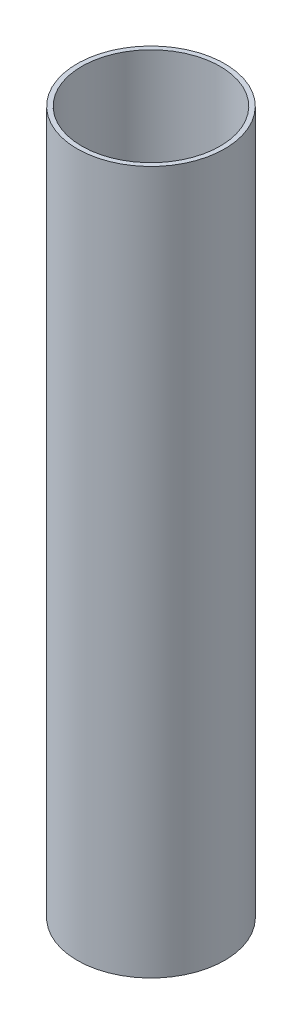
ISO-10303-21;
HEADER;
FILE_DESCRIPTION(('STEP AP214'),'2;1');
FILE_NAME('part.step','',(''),(''),'','','');
FILE_SCHEMA(('AUTOMOTIVE_DESIGN { 1 0 10303 214 1 1 1 1 }'));
ENDSEC;
DATA;
#1=APPLICATION_CONTEXT('core data for automotive mechanical design processes');
#2=APPLICATION_PROTOCOL_DEFINITION('international standard','automotive_design',2000,#1);
#3=PRODUCT_CONTEXT('',#1,'mechanical');
#4=PRODUCT('Part','Part','',(#3));
#5=PRODUCT_RELATED_PRODUCT_CATEGORY('part','',(#4));
#6=PRODUCT_DEFINITION_FORMATION('','',#4);
#7=PRODUCT_DEFINITION_CONTEXT('part definition',#1,'design');
#8=PRODUCT_DEFINITION('design','',#6,#7);
#9=PRODUCT_DEFINITION_SHAPE('','',#8);
#10=(LENGTH_UNIT() NAMED_UNIT(*) SI_UNIT(.MILLI.,.METRE.));
#11=(NAMED_UNIT(*) PLANE_ANGLE_UNIT() SI_UNIT($,.RADIAN.));
#12=(NAMED_UNIT(*) SI_UNIT($,.STERADIAN.) SOLID_ANGLE_UNIT());
#13=UNCERTAINTY_MEASURE_WITH_UNIT(LENGTH_MEASURE(1.E-05),#10,'distance_accuracy_value','');
#14=(GEOMETRIC_REPRESENTATION_CONTEXT(3) GLOBAL_UNCERTAINTY_ASSIGNED_CONTEXT((#13)) GLOBAL_UNIT_ASSIGNED_CONTEXT((#10,
#11,#12)) REPRESENTATION_CONTEXT('',''));
#15=CARTESIAN_POINT('',(0.,0.,0.));
#16=DIRECTION('',(0.,0.,1.));
#17=DIRECTION('',(1.,0.,0.));
#18=AXIS2_PLACEMENT_3D('',#15,#16,#17);
#19=CARTESIAN_POINT('',(0.,381.,0.));
#20=DIRECTION('',(0.,1.,0.));
#21=DIRECTION('',(0.,0.,1.));
#22=AXIS2_PLACEMENT_3D('',#19,#20,#21);
#23=PLANE('',#22);
#24=CARTESIAN_POINT('',(0.,381.,0.));
#25=DIRECTION('',(0.,1.,0.));
#26=DIRECTION('',(0.,0.,1.));
#27=AXIS2_PLACEMENT_3D('',#24,#25,#26);
#28=CIRCLE('',#27,40.);
#29=CARTESIAN_POINT('',(0.,381.,40.));
#30=VERTEX_POINT('',#29);
#31=EDGE_CURVE('E10',#30,#30,#28,.T.);
#32=ORIENTED_EDGE('',*,*,#31,.T.);
#33=EDGE_LOOP('',(#32));
#34=FACE_BOUND('',#33,.T.);
#35=CARTESIAN_POINT('',(0.,381.,0.));
#36=DIRECTION('',(0.,1.,0.));
#37=DIRECTION('',(0.,0.,1.));
#38=AXIS2_PLACEMENT_3D('',#35,#36,#37);
#39=CIRCLE('',#38,37.5);
#40=CARTESIAN_POINT('',(0.,381.,37.5));
#41=VERTEX_POINT('',#40);
#42=EDGE_CURVE('E41',#41,#41,#39,.T.);
#43=ORIENTED_EDGE('',*,*,#42,.F.);
#44=EDGE_LOOP('',(#43));
#45=FACE_BOUND('',#44,.T.);
#46=ADVANCED_FACE('F30',(#34,#45),#23,.T.);
#47=CARTESIAN_POINT('',(0.,0.,0.));
#48=DIRECTION('',(0.,1.,0.));
#49=DIRECTION('',(0.,0.,1.));
#50=AXIS2_PLACEMENT_3D('',#47,#48,#49);
#51=PLANE('',#50);
#52=CARTESIAN_POINT('',(0.,0.,0.));
#53=DIRECTION('',(0.,1.,0.));
#54=DIRECTION('',(0.,0.,1.));
#55=AXIS2_PLACEMENT_3D('',#52,#53,#54);
#56=CIRCLE('',#55,40.);
#57=CARTESIAN_POINT('',(0.,0.,40.));
#58=VERTEX_POINT('',#57);
#59=EDGE_CURVE('E34',#58,#58,#56,.T.);
#60=ORIENTED_EDGE('',*,*,#59,.F.);
#61=EDGE_LOOP('',(#60));
#62=FACE_BOUND('',#61,.T.);
#63=CARTESIAN_POINT('',(0.,0.,0.));
#64=DIRECTION('',(0.,1.,0.));
#65=DIRECTION('',(0.,0.,1.));
#66=AXIS2_PLACEMENT_3D('',#63,#64,#65);
#67=CIRCLE('',#66,37.5);
#68=CARTESIAN_POINT('',(0.,0.,37.5));
#69=VERTEX_POINT('',#68);
#70=EDGE_CURVE('E43',#69,#69,#67,.T.);
#71=ORIENTED_EDGE('',*,*,#70,.T.);
#72=EDGE_LOOP('',(#71));
#73=FACE_BOUND('',#72,.T.);
#74=ADVANCED_FACE('F53',(#62,#73),#51,.F.);
#75=CARTESIAN_POINT('',(0.,381.,0.));
#76=DIRECTION('',(0.,-1.,0.));
#77=DIRECTION('',(0.,0.,-1.));
#78=AXIS2_PLACEMENT_3D('',#75,#76,#77);
#79=CYLINDRICAL_SURFACE('',#78,40.);
#80=ORIENTED_EDGE('',*,*,#31,.F.);
#81=EDGE_LOOP('',(#80));
#82=FACE_BOUND('',#81,.T.);
#83=ORIENTED_EDGE('',*,*,#59,.T.);
#84=EDGE_LOOP('',(#83));
#85=FACE_BOUND('',#84,.T.);
#86=ADVANCED_FACE('F32',(#82,#85),#79,.T.);
#87=CARTESIAN_POINT('',(0.,381.,0.));
#88=DIRECTION('',(0.,-1.,0.));
#89=DIRECTION('',(0.,0.,-1.));
#90=AXIS2_PLACEMENT_3D('',#87,#88,#89);
#91=CYLINDRICAL_SURFACE('',#90,37.5);
#92=ORIENTED_EDGE('',*,*,#42,.T.);
#93=EDGE_LOOP('',(#92));
#94=FACE_BOUND('',#93,.T.);
#95=ORIENTED_EDGE('',*,*,#70,.F.);
#96=EDGE_LOOP('',(#95));
#97=FACE_BOUND('',#96,.T.);
#98=ADVANCED_FACE('F49',(#94,#97),#91,.F.);
#99=CLOSED_SHELL('',(#46,#74,#86,#98));
#100=MANIFOLD_SOLID_BREP('B2',#99);
#101=ADVANCED_BREP_SHAPE_REPRESENTATION('',(#18,#100),#14);
#102=SHAPE_DEFINITION_REPRESENTATION(#9,#101);
ENDSEC;
END-ISO-10303-21;
